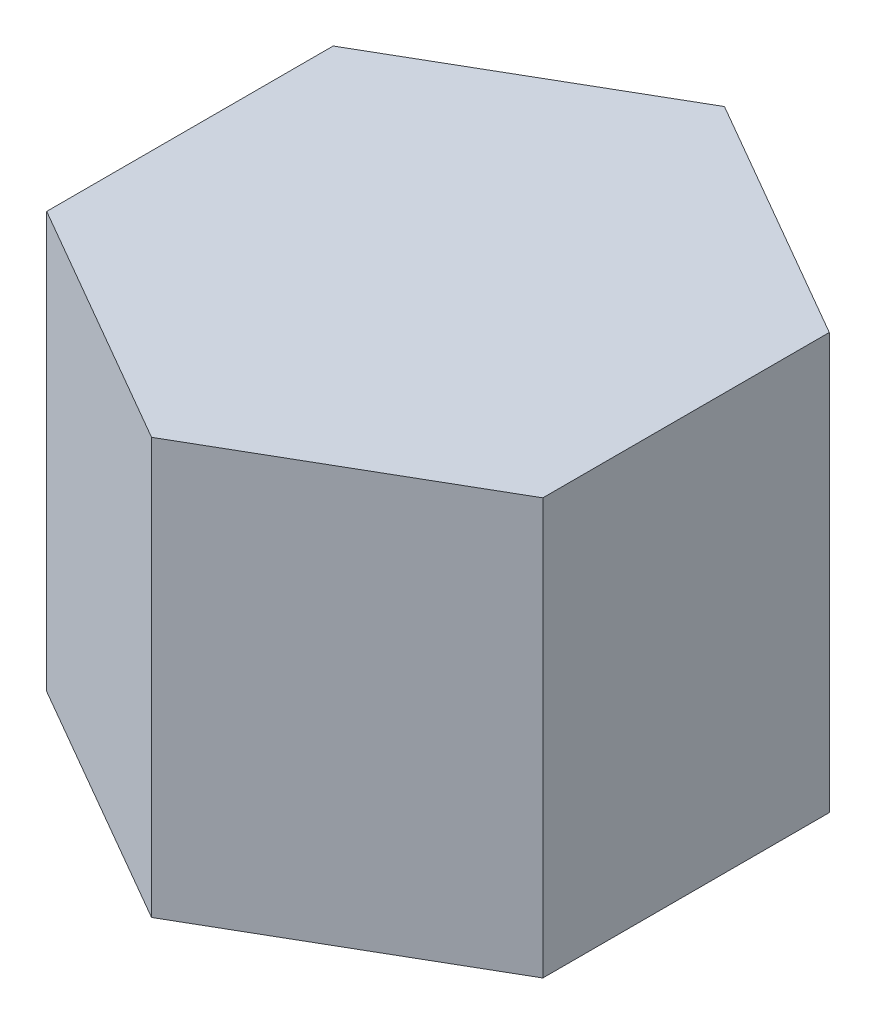
ISO-10303-21;
HEADER;
FILE_DESCRIPTION(('STEP AP214'),'2;1');
FILE_NAME('part.step','',(''),(''),'','','');
FILE_SCHEMA(('AUTOMOTIVE_DESIGN { 1 0 10303 214 1 1 1 1 }'));
ENDSEC;
DATA;
#1=APPLICATION_CONTEXT('core data for automotive mechanical design processes');
#2=APPLICATION_PROTOCOL_DEFINITION('international standard','automotive_design',2000,#1);
#3=PRODUCT_CONTEXT('',#1,'mechanical');
#4=PRODUCT('Part','Part','',(#3));
#5=PRODUCT_RELATED_PRODUCT_CATEGORY('part','',(#4));
#6=PRODUCT_DEFINITION_FORMATION('','',#4);
#7=PRODUCT_DEFINITION_CONTEXT('part definition',#1,'design');
#8=PRODUCT_DEFINITION('design','',#6,#7);
#9=PRODUCT_DEFINITION_SHAPE('','',#8);
#10=(LENGTH_UNIT() NAMED_UNIT(*) SI_UNIT(.MILLI.,.METRE.));
#11=(NAMED_UNIT(*) PLANE_ANGLE_UNIT() SI_UNIT($,.RADIAN.));
#12=(NAMED_UNIT(*) SI_UNIT($,.STERADIAN.) SOLID_ANGLE_UNIT());
#13=UNCERTAINTY_MEASURE_WITH_UNIT(LENGTH_MEASURE(1.E-05),#10,'distance_accuracy_value','');
#14=(GEOMETRIC_REPRESENTATION_CONTEXT(3) GLOBAL_UNCERTAINTY_ASSIGNED_CONTEXT((#13)) GLOBAL_UNIT_ASSIGNED_CONTEXT((#10,
#11,#12)) REPRESENTATION_CONTEXT('',''));
#15=CARTESIAN_POINT('',(0.,0.,0.));
#16=DIRECTION('',(0.,0.,1.));
#17=DIRECTION('',(1.,0.,0.));
#18=AXIS2_PLACEMENT_3D('',#15,#16,#17);
#19=CARTESIAN_POINT('',(205.142660308706,-148.537700895744,288.908895009141));
#20=DIRECTION('',(-0.499999999999943,0.,-0.866025403784472));
#21=DIRECTION('',(-0.866025403784472,0.,0.499999999999943));
#22=AXIS2_PLACEMENT_3D('',#19,#20,#21);
#23=PLANE('',#22);
#24=CARTESIAN_POINT('',(204.839551417382,-149.045793579175,289.083895009141));
#25=DIRECTION('',(0.866025403784471,0.,-0.499999999999943));
#26=VECTOR('',#25,1.);
#27=LINE('',#24,#26);
#28=CARTESIAN_POINT('',(204.839551417382,-149.045793579175,289.083895009141));
#29=VERTEX_POINT('',#28);
#30=CARTESIAN_POINT('',(205.142660308706,-149.045793579175,288.908895009141));
#31=VERTEX_POINT('',#30);
#32=EDGE_CURVE('E170',#29,#31,#27,.T.);
#33=ORIENTED_EDGE('',*,*,#32,.T.);
#34=CARTESIAN_POINT('',(205.142660308706,-148.537700895744,288.908895009141));
#35=DIRECTION('',(0.,-1.,0.));
#36=VECTOR('',#35,1.);
#37=LINE('',#34,#36);
#38=CARTESIAN_POINT('',(205.142660308706,-148.537700895744,288.908895009141));
#39=VERTEX_POINT('',#38);
#40=EDGE_CURVE('E35',#39,#31,#37,.T.);
#41=ORIENTED_EDGE('',*,*,#40,.F.);
#42=CARTESIAN_POINT('',(204.839551417382,-148.537700895744,289.083895009141));
#43=DIRECTION('',(0.866025403784471,0.,-0.499999999999943));
#44=VECTOR('',#43,1.);
#45=LINE('',#42,#44);
#46=CARTESIAN_POINT('',(204.839551417382,-148.537700895744,289.083895009141));
#47=VERTEX_POINT('',#46);
#48=EDGE_CURVE('E159',#47,#39,#45,.T.);
#49=ORIENTED_EDGE('',*,*,#48,.F.);
#50=CARTESIAN_POINT('',(204.839551417382,-148.537700895744,289.083895009141));
#51=DIRECTION('',(0.,-1.,0.));
#52=VECTOR('',#51,1.);
#53=LINE('',#50,#52);
#54=EDGE_CURVE('E10',#47,#29,#53,.T.);
#55=ORIENTED_EDGE('',*,*,#54,.T.);
#56=EDGE_LOOP('',(#33,#41,#49,#55));
#57=FACE_BOUND('',#56,.T.);
#58=ADVANCED_FACE('F16',(#57),#23,.F.);
#59=CARTESIAN_POINT('',(204.839551417382,-148.537700895744,289.083895009141));
#60=DIRECTION('',(0.500000000000062,0.,-0.866025403784403));
#61=DIRECTION('',(-0.866025403784403,0.,-0.500000000000062));
#62=AXIS2_PLACEMENT_3D('',#59,#60,#61);
#63=PLANE('',#62);
#64=CARTESIAN_POINT('',(204.536442526057,-149.045793579175,288.908895009141));
#65=DIRECTION('',(0.866025403784403,0.,0.500000000000062));
#66=VECTOR('',#65,1.);
#67=LINE('',#64,#66);
#68=CARTESIAN_POINT('',(204.536442526057,-149.045793579175,288.908895009141));
#69=VERTEX_POINT('',#68);
#70=EDGE_CURVE('E167',#69,#29,#67,.T.);
#71=ORIENTED_EDGE('',*,*,#70,.T.);
#72=ORIENTED_EDGE('',*,*,#54,.F.);
#73=CARTESIAN_POINT('',(204.536442526057,-148.537700895744,288.908895009141));
#74=DIRECTION('',(0.866025403784403,0.,0.500000000000062));
#75=VECTOR('',#74,1.);
#76=LINE('',#73,#75);
#77=CARTESIAN_POINT('',(204.536442526057,-148.537700895744,288.908895009141));
#78=VERTEX_POINT('',#77);
#79=EDGE_CURVE('E156',#78,#47,#76,.T.);
#80=ORIENTED_EDGE('',*,*,#79,.F.);
#81=CARTESIAN_POINT('',(204.536442526057,-148.537700895744,288.908895009141));
#82=DIRECTION('',(0.,-1.,0.));
#83=VECTOR('',#82,1.);
#84=LINE('',#81,#83);
#85=EDGE_CURVE('E27',#78,#69,#84,.T.);
#86=ORIENTED_EDGE('',*,*,#85,.T.);
#87=EDGE_LOOP('',(#71,#72,#80,#86));
#88=FACE_BOUND('',#87,.T.);
#89=ADVANCED_FACE('F189',(#88),#63,.F.);
#90=CARTESIAN_POINT('',(204.536442526057,-148.537700895744,290.831971220494));
#91=DIRECTION('',(1.,0.,0.));
#92=DIRECTION('',(0.,1.,0.));
#93=AXIS2_PLACEMENT_3D('',#90,#91,#92);
#94=PLANE('',#93);
#95=CARTESIAN_POINT('',(204.536442526057,-149.045793579175,288.558895009141));
#96=DIRECTION('',(0.,0.,1.));
#97=VECTOR('',#96,1.);
#98=LINE('',#95,#97);
#99=CARTESIAN_POINT('',(204.536442526057,-149.045793579175,288.558895009141));
#100=VERTEX_POINT('',#99);
#101=EDGE_CURVE('E163',#100,#69,#98,.T.);
#102=ORIENTED_EDGE('',*,*,#101,.T.);
#103=ORIENTED_EDGE('',*,*,#85,.F.);
#104=CARTESIAN_POINT('',(204.536442526057,-148.537700895744,288.558895009141));
#105=DIRECTION('',(0.,0.,1.));
#106=VECTOR('',#105,1.);
#107=LINE('',#104,#106);
#108=CARTESIAN_POINT('',(204.536442526057,-148.537700895744,288.558895009141));
#109=VERTEX_POINT('',#108);
#110=EDGE_CURVE('E106',#109,#78,#107,.T.);
#111=ORIENTED_EDGE('',*,*,#110,.F.);
#112=CARTESIAN_POINT('',(204.536442526057,-148.537700895744,288.558895009141));
#113=DIRECTION('',(0.,-1.,0.));
#114=VECTOR('',#113,1.);
#115=LINE('',#112,#114);
#116=EDGE_CURVE('E94',#109,#100,#115,.T.);
#117=ORIENTED_EDGE('',*,*,#116,.T.);
#118=EDGE_LOOP('',(#102,#103,#111,#117));
#119=FACE_BOUND('',#118,.T.);
#120=ADVANCED_FACE('F198',(#119),#94,.F.);
#121=CARTESIAN_POINT('',(204.536442526057,-148.537700895744,288.558895009141));
#122=DIRECTION('',(0.499999999999978,0.,0.866025403784452));
#123=DIRECTION('',(0.866025403784452,0.,-0.499999999999978));
#124=AXIS2_PLACEMENT_3D('',#121,#122,#123);
#125=PLANE('',#124);
#126=CARTESIAN_POINT('',(204.839551417382,-149.045793579175,288.383895009141));
#127=DIRECTION('',(-0.866025403784452,0.,0.499999999999978));
#128=VECTOR('',#127,1.);
#129=LINE('',#126,#128);
#130=CARTESIAN_POINT('',(204.839551417382,-149.045793579175,288.383895009141));
#131=VERTEX_POINT('',#130);
#132=EDGE_CURVE('E162',#131,#100,#129,.T.);
#133=ORIENTED_EDGE('',*,*,#132,.T.);
#134=ORIENTED_EDGE('',*,*,#116,.F.);
#135=CARTESIAN_POINT('',(204.839551417382,-148.537700895744,288.383895009141));
#136=DIRECTION('',(-0.866025403784452,0.,0.499999999999978));
#137=VECTOR('',#136,1.);
#138=LINE('',#135,#137);
#139=CARTESIAN_POINT('',(204.839551417382,-148.537700895744,288.383895009141));
#140=VERTEX_POINT('',#139);
#141=EDGE_CURVE('E98',#140,#109,#138,.T.);
#142=ORIENTED_EDGE('',*,*,#141,.F.);
#143=CARTESIAN_POINT('',(204.839551417382,-148.537700895744,288.383895009141));
#144=DIRECTION('',(0.,-1.,0.));
#145=VECTOR('',#144,1.);
#146=LINE('',#143,#145);
#147=EDGE_CURVE('E79',#140,#131,#146,.T.);
#148=ORIENTED_EDGE('',*,*,#147,.T.);
#149=EDGE_LOOP('',(#133,#134,#142,#148));
#150=FACE_BOUND('',#149,.T.);
#151=ADVANCED_FACE('F100',(#150),#125,.F.);
#152=CARTESIAN_POINT('',(204.839551417382,-148.537700895744,288.383895009141));
#153=DIRECTION('',(-0.499999999999943,0.,0.866025403784472));
#154=DIRECTION('',(0.866025403784472,0.,0.499999999999943));
#155=AXIS2_PLACEMENT_3D('',#152,#153,#154);
#156=PLANE('',#155);
#157=CARTESIAN_POINT('',(205.142660308706,-149.045793579175,288.558895009141));
#158=DIRECTION('',(-0.866025403784471,0.,-0.499999999999943));
#159=VECTOR('',#158,1.);
#160=LINE('',#157,#159);
#161=CARTESIAN_POINT('',(205.142660308706,-149.045793579175,288.558895009141));
#162=VERTEX_POINT('',#161);
#163=EDGE_CURVE('E88',#162,#131,#160,.T.);
#164=ORIENTED_EDGE('',*,*,#163,.T.);
#165=ORIENTED_EDGE('',*,*,#147,.F.);
#166=CARTESIAN_POINT('',(205.142660308706,-148.537700895744,288.558895009141));
#167=DIRECTION('',(-0.866025403784471,0.,-0.499999999999943));
#168=VECTOR('',#167,1.);
#169=LINE('',#166,#168);
#170=CARTESIAN_POINT('',(205.142660308706,-148.537700895744,288.558895009141));
#171=VERTEX_POINT('',#170);
#172=EDGE_CURVE('E84',#171,#140,#169,.T.);
#173=ORIENTED_EDGE('',*,*,#172,.F.);
#174=CARTESIAN_POINT('',(205.142660308706,-148.537700895744,288.558895009141));
#175=DIRECTION('',(0.,-1.,0.));
#176=VECTOR('',#175,1.);
#177=LINE('',#174,#176);
#178=EDGE_CURVE('E58',#171,#162,#177,.T.);
#179=ORIENTED_EDGE('',*,*,#178,.T.);
#180=EDGE_LOOP('',(#164,#165,#173,#179));
#181=FACE_BOUND('',#180,.T.);
#182=ADVANCED_FACE('F82',(#181),#156,.F.);
#183=CARTESIAN_POINT('',(205.142660308706,-148.537700895744,290.831971220494));
#184=DIRECTION('',(-1.,0.,0.));
#185=DIRECTION('',(0.,-1.,0.));
#186=AXIS2_PLACEMENT_3D('',#183,#184,#185);
#187=PLANE('',#186);
#188=CARTESIAN_POINT('',(205.142660308706,-149.045793579175,288.908895009141));
#189=DIRECTION('',(0.,0.,-1.));
#190=VECTOR('',#189,1.);
#191=LINE('',#188,#190);
#192=EDGE_CURVE('E160',#31,#162,#191,.T.);
#193=ORIENTED_EDGE('',*,*,#192,.T.);
#194=ORIENTED_EDGE('',*,*,#178,.F.);
#195=CARTESIAN_POINT('',(205.142660308706,-148.537700895744,288.908895009141));
#196=DIRECTION('',(0.,0.,-1.));
#197=VECTOR('',#196,1.);
#198=LINE('',#195,#197);
#199=EDGE_CURVE('E112',#39,#171,#198,.T.);
#200=ORIENTED_EDGE('',*,*,#199,.F.);
#201=ORIENTED_EDGE('',*,*,#40,.T.);
#202=EDGE_LOOP('',(#193,#194,#200,#201));
#203=FACE_BOUND('',#202,.T.);
#204=ADVANCED_FACE('F131',(#203),#187,.F.);
#205=CARTESIAN_POINT('',(206.339551417382,-148.537700895744,290.831971220494));
#206=DIRECTION('',(0.,-1.,0.));
#207=DIRECTION('',(1.,0.,0.));
#208=AXIS2_PLACEMENT_3D('',#205,#206,#207);
#209=PLANE('',#208);
#210=ORIENTED_EDGE('',*,*,#48,.T.);
#211=ORIENTED_EDGE('',*,*,#199,.T.);
#212=ORIENTED_EDGE('',*,*,#172,.T.);
#213=ORIENTED_EDGE('',*,*,#141,.T.);
#214=ORIENTED_EDGE('',*,*,#110,.T.);
#215=ORIENTED_EDGE('',*,*,#79,.T.);
#216=EDGE_LOOP('',(#210,#211,#212,#213,#214,#215));
#217=FACE_BOUND('',#216,.T.);
#218=ADVANCED_FACE('F111',(#217),#209,.F.);
#219=CARTESIAN_POINT('',(206.339551417382,-149.045793579175,290.831971220494));
#220=DIRECTION('',(0.,-1.,0.));
#221=DIRECTION('',(1.,0.,0.));
#222=AXIS2_PLACEMENT_3D('',#219,#220,#221);
#223=PLANE('',#222);
#224=ORIENTED_EDGE('',*,*,#32,.F.);
#225=ORIENTED_EDGE('',*,*,#70,.F.);
#226=ORIENTED_EDGE('',*,*,#101,.F.);
#227=ORIENTED_EDGE('',*,*,#132,.F.);
#228=ORIENTED_EDGE('',*,*,#163,.F.);
#229=ORIENTED_EDGE('',*,*,#192,.F.);
#230=EDGE_LOOP('',(#224,#225,#226,#227,#228,#229));
#231=FACE_BOUND('',#230,.T.);
#232=ADVANCED_FACE('F130',(#231),#223,.T.);
#233=CLOSED_SHELL('',(#58,#89,#120,#151,#182,#204,#218,#232));
#234=MANIFOLD_SOLID_BREP('B1',#233);
#235=ADVANCED_BREP_SHAPE_REPRESENTATION('',(#18,#234),#14);
#236=SHAPE_DEFINITION_REPRESENTATION(#9,#235);
ENDSEC;
END-ISO-10303-21;
